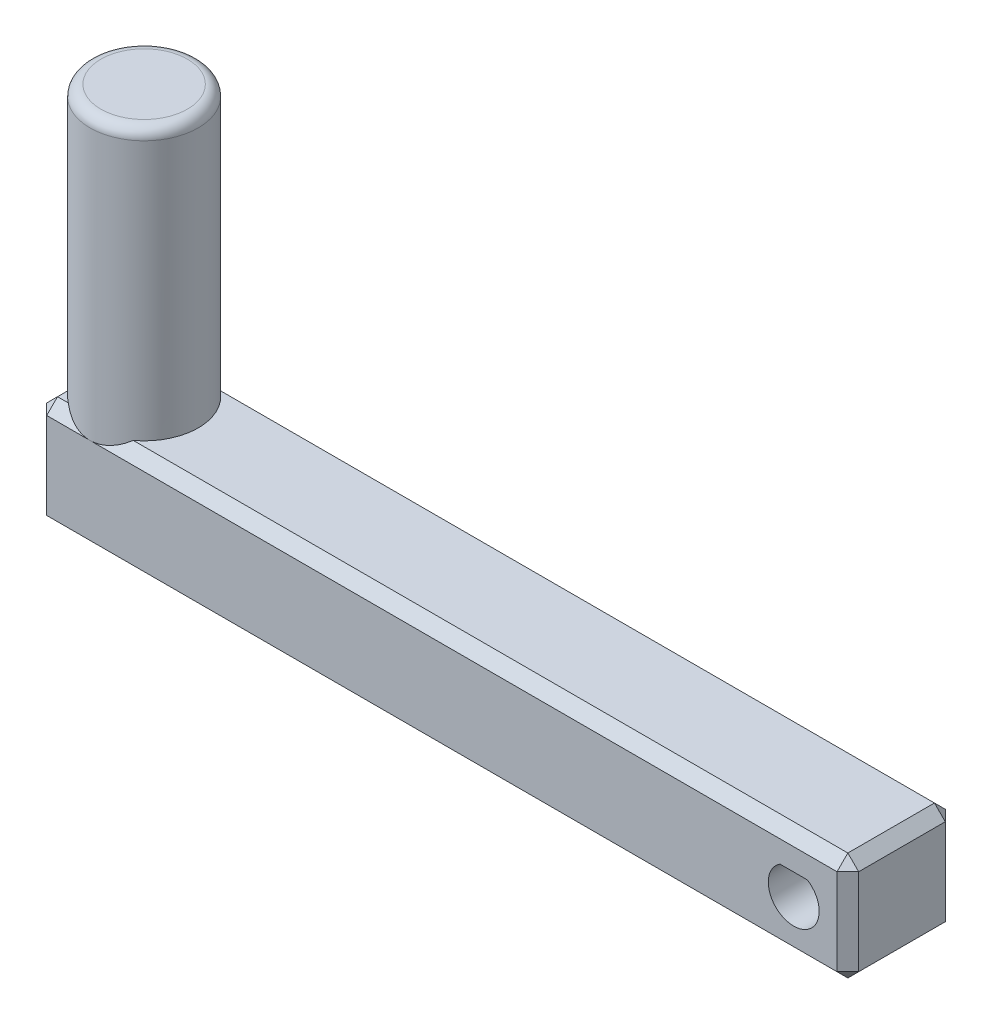
ISO-10303-21;
HEADER;
FILE_DESCRIPTION(('STEP AP214'),'2;1');
FILE_NAME('part.step','',(''),(''),'','','');
FILE_SCHEMA(('AUTOMOTIVE_DESIGN { 1 0 10303 214 1 1 1 1 }'));
ENDSEC;
DATA;
#1=APPLICATION_CONTEXT('core data for automotive mechanical design processes');
#2=APPLICATION_PROTOCOL_DEFINITION('international standard','automotive_design',2000,#1);
#3=PRODUCT_CONTEXT('',#1,'mechanical');
#4=PRODUCT('Part','Part','',(#3));
#5=PRODUCT_RELATED_PRODUCT_CATEGORY('part','',(#4));
#6=PRODUCT_DEFINITION_FORMATION('','',#4);
#7=PRODUCT_DEFINITION_CONTEXT('part definition',#1,'design');
#8=PRODUCT_DEFINITION('design','',#6,#7);
#9=PRODUCT_DEFINITION_SHAPE('','',#8);
#10=(LENGTH_UNIT() NAMED_UNIT(*) SI_UNIT(.MILLI.,.METRE.));
#11=(NAMED_UNIT(*) PLANE_ANGLE_UNIT() SI_UNIT($,.RADIAN.));
#12=(NAMED_UNIT(*) SI_UNIT($,.STERADIAN.) SOLID_ANGLE_UNIT());
#13=UNCERTAINTY_MEASURE_WITH_UNIT(LENGTH_MEASURE(1.E-05),#10,'distance_accuracy_value','');
#14=(GEOMETRIC_REPRESENTATION_CONTEXT(3) GLOBAL_UNCERTAINTY_ASSIGNED_CONTEXT((#13)) GLOBAL_UNIT_ASSIGNED_CONTEXT((#10,
#11,#12)) REPRESENTATION_CONTEXT('',''));
#15=CARTESIAN_POINT('',(0.,0.,0.));
#16=DIRECTION('',(0.,0.,1.));
#17=DIRECTION('',(1.,0.,0.));
#18=AXIS2_PLACEMENT_3D('',#15,#16,#17);
#19=CARTESIAN_POINT('',(0.,10.,0.));
#20=DIRECTION('',(0.,0.,1.));
#21=DIRECTION('',(1.,0.,0.));
#22=AXIS2_PLACEMENT_3D('',#19,#20,#21);
#23=PLANE('',#22);
#24=DIRECTION('',(0.,1.,0.));
#25=VECTOR('',#24,1.);
#26=CARTESIAN_POINT('',(-74.,10.,0.));
#27=LINE('',#26,#25);
#28=CARTESIAN_POINT('',(-74.,1.00000000000001,0.));
#29=VERTEX_POINT('',#28);
#30=CARTESIAN_POINT('',(-74.,8.99999999999998,0.));
#31=VERTEX_POINT('',#30);
#32=EDGE_CURVE('E212',#29,#31,#27,.T.);
#33=ORIENTED_EDGE('',*,*,#32,.T.);
#34=DIRECTION('',(1.,0.,0.));
#35=VECTOR('',#34,1.);
#36=CARTESIAN_POINT('',(0.,8.99999999999998,0.));
#37=LINE('',#36,#35);
#38=CARTESIAN_POINT('',(-70.,8.99999999999998,0.));
#39=VERTEX_POINT('',#38);
#40=EDGE_CURVE('E220',#31,#39,#37,.T.);
#41=ORIENTED_EDGE('',*,*,#40,.T.);
#42=DIRECTION('',(1.,0.,0.));
#43=VECTOR('',#42,1.);
#44=CARTESIAN_POINT('',(0.,8.99999999999998,0.));
#45=LINE('',#44,#43);
#46=CARTESIAN_POINT('',(-1.00000000000001,8.99999999999998,0.));
#47=VERTEX_POINT('',#46);
#48=EDGE_CURVE('E218',#39,#47,#45,.T.);
#49=ORIENTED_EDGE('',*,*,#48,.T.);
#50=DIRECTION('',(0.,-1.,0.));
#51=VECTOR('',#50,1.);
#52=CARTESIAN_POINT('',(-1.00000000000001,10.,0.));
#53=LINE('',#52,#51);
#54=CARTESIAN_POINT('',(-1.00000000000001,1.00000000000001,0.));
#55=VERTEX_POINT('',#54);
#56=EDGE_CURVE('E216',#47,#55,#53,.T.);
#57=ORIENTED_EDGE('',*,*,#56,.T.);
#58=DIRECTION('',(-1.,0.,0.));
#59=VECTOR('',#58,1.);
#60=CARTESIAN_POINT('',(-75.,1.00000000000001,0.));
#61=LINE('',#60,#59);
#62=EDGE_CURVE('E214',#55,#29,#61,.T.);
#63=ORIENTED_EDGE('',*,*,#62,.T.);
#64=EDGE_LOOP('',(#33,#41,#49,#57,#63));
#65=FACE_BOUND('',#64,.T.);
#66=DIRECTION('',(1.,0.,0.));
#67=VECTOR('',#66,1.);
#68=CARTESIAN_POINT('',(0.,6.97727084639409,0.));
#69=LINE('',#68,#67);
#70=CARTESIAN_POINT('',(-6.27,6.97727084639409,0.));
#71=VERTEX_POINT('',#70);
#72=CARTESIAN_POINT('',(-3.73,6.97727084639409,0.));
#73=VERTEX_POINT('',#72);
#74=EDGE_CURVE('E167',#71,#73,#69,.T.);
#75=ORIENTED_EDGE('',*,*,#74,.F.);
#76=CARTESIAN_POINT('',(-5.,5.,0.));
#77=DIRECTION('',(0.,0.,1.));
#78=DIRECTION('',(1.,0.,0.));
#79=AXIS2_PLACEMENT_3D('',#76,#77,#78);
#80=CIRCLE('',#79,2.35);
#81=EDGE_CURVE('E175',#71,#73,#80,.T.);
#82=ORIENTED_EDGE('',*,*,#81,.T.);
#83=EDGE_LOOP('',(#75,#82));
#84=FACE_BOUND('',#83,.T.);
#85=ADVANCED_FACE('F35',(#65,#84),#23,.F.);
#86=CARTESIAN_POINT('',(0.,10.,10.));
#87=DIRECTION('',(0.,0.,-1.));
#88=DIRECTION('',(-1.,0.,0.));
#89=AXIS2_PLACEMENT_3D('',#86,#87,#88);
#90=PLANE('',#89);
#91=DIRECTION('',(0.,1.,0.));
#92=VECTOR('',#91,1.);
#93=CARTESIAN_POINT('',(-1.00000000000001,10.,10.));
#94=LINE('',#93,#92);
#95=CARTESIAN_POINT('',(-1.00000000000001,1.00000000000001,10.));
#96=VERTEX_POINT('',#95);
#97=CARTESIAN_POINT('',(-1.00000000000001,8.99999999999999,10.));
#98=VERTEX_POINT('',#97);
#99=EDGE_CURVE('E201',#96,#98,#94,.T.);
#100=ORIENTED_EDGE('',*,*,#99,.T.);
#101=DIRECTION('',(-1.,0.,0.));
#102=VECTOR('',#101,1.);
#103=CARTESIAN_POINT('',(0.,8.99999999999999,10.));
#104=LINE('',#103,#102);
#105=CARTESIAN_POINT('',(-70.,8.99999999999999,10.));
#106=VERTEX_POINT('',#105);
#107=EDGE_CURVE('E206',#98,#106,#104,.T.);
#108=ORIENTED_EDGE('',*,*,#107,.T.);
#109=DIRECTION('',(-1.,0.,0.));
#110=VECTOR('',#109,1.);
#111=CARTESIAN_POINT('',(0.,8.99999999999999,10.));
#112=LINE('',#111,#110);
#113=CARTESIAN_POINT('',(-74.,8.99999999999999,10.));
#114=VERTEX_POINT('',#113);
#115=EDGE_CURVE('E203',#106,#114,#112,.T.);
#116=ORIENTED_EDGE('',*,*,#115,.T.);
#117=DIRECTION('',(0.,-1.,0.));
#118=VECTOR('',#117,1.);
#119=CARTESIAN_POINT('',(-74.,10.,10.));
#120=LINE('',#119,#118);
#121=CARTESIAN_POINT('',(-74.,1.00000000000001,10.));
#122=VERTEX_POINT('',#121);
#123=EDGE_CURVE('E199',#114,#122,#120,.T.);
#124=ORIENTED_EDGE('',*,*,#123,.T.);
#125=DIRECTION('',(1.,0.,0.));
#126=VECTOR('',#125,1.);
#127=CARTESIAN_POINT('',(0.,1.00000000000001,10.));
#128=LINE('',#127,#126);
#129=EDGE_CURVE('E197',#122,#96,#128,.T.);
#130=ORIENTED_EDGE('',*,*,#129,.T.);
#131=EDGE_LOOP('',(#100,#108,#116,#124,#130));
#132=FACE_BOUND('',#131,.T.);
#133=DIRECTION('',(1.,0.,0.));
#134=VECTOR('',#133,1.);
#135=CARTESIAN_POINT('',(0.,6.97727084639409,10.));
#136=LINE('',#135,#134);
#137=CARTESIAN_POINT('',(-6.27,6.97727084639409,10.));
#138=VERTEX_POINT('',#137);
#139=CARTESIAN_POINT('',(-3.73,6.97727084639409,10.));
#140=VERTEX_POINT('',#139);
#141=EDGE_CURVE('E170',#138,#140,#136,.T.);
#142=ORIENTED_EDGE('',*,*,#141,.T.);
#143=CARTESIAN_POINT('',(-5.,5.,10.));
#144=DIRECTION('',(0.,0.,1.));
#145=DIRECTION('',(1.,0.,0.));
#146=AXIS2_PLACEMENT_3D('',#143,#144,#145);
#147=CIRCLE('',#146,2.35);
#148=EDGE_CURVE('E180',#138,#140,#147,.T.);
#149=ORIENTED_EDGE('',*,*,#148,.F.);
#150=EDGE_LOOP('',(#142,#149));
#151=FACE_BOUND('',#150,.T.);
#152=ADVANCED_FACE('F353',(#132,#151),#90,.F.);
#153=CARTESIAN_POINT('',(0.,10.,0.));
#154=DIRECTION('',(0.,-1.,0.));
#155=DIRECTION('',(0.,0.,-1.));
#156=AXIS2_PLACEMENT_3D('',#153,#154,#155);
#157=PLANE('',#156);
#158=CARTESIAN_POINT('',(-70.,10.,5.));
#159=DIRECTION('',(0.,1.,0.));
#160=DIRECTION('',(0.,0.,1.));
#161=AXIS2_PLACEMENT_3D('',#158,#159,#160);
#162=CIRCLE('',#161,5.);
#163=CARTESIAN_POINT('',(-66.9999999999999,10.,8.99999999999998));
#164=VERTEX_POINT('',#163);
#165=CARTESIAN_POINT('',(-66.9999999999999,10.,1.00000000000002));
#166=VERTEX_POINT('',#165);
#167=EDGE_CURVE('E186',#164,#166,#162,.T.);
#168=ORIENTED_EDGE('',*,*,#167,.F.);
#169=DIRECTION('',(1.,0.,0.));
#170=VECTOR('',#169,1.);
#171=CARTESIAN_POINT('',(0.,10.,8.99999999999998));
#172=LINE('',#171,#170);
#173=CARTESIAN_POINT('',(-1.00000000000001,10.,8.99999999999998));
#174=VERTEX_POINT('',#173);
#175=EDGE_CURVE('E247',#164,#174,#172,.T.);
#176=ORIENTED_EDGE('',*,*,#175,.T.);
#177=DIRECTION('',(0.,0.,-1.));
#178=VECTOR('',#177,1.);
#179=CARTESIAN_POINT('',(-1.00000000000001,10.,0.));
#180=LINE('',#179,#178);
#181=CARTESIAN_POINT('',(-1.00000000000001,10.,1.00000000000001));
#182=VERTEX_POINT('',#181);
#183=EDGE_CURVE('E245',#174,#182,#180,.T.);
#184=ORIENTED_EDGE('',*,*,#183,.T.);
#185=DIRECTION('',(-1.,0.,0.));
#186=VECTOR('',#185,1.);
#187=CARTESIAN_POINT('',(0.,10.,1.00000000000001));
#188=LINE('',#187,#186);
#189=EDGE_CURVE('E243',#182,#166,#188,.T.);
#190=ORIENTED_EDGE('',*,*,#189,.T.);
#191=EDGE_LOOP('',(#168,#176,#184,#190));
#192=FACE_BOUND('',#191,.T.);
#193=ADVANCED_FACE('F359',(#192),#157,.F.);
#194=CARTESIAN_POINT('',(-73.,10.,1.00000000000002));
#195=VERTEX_POINT('',#194);
#196=CARTESIAN_POINT('',(-74.,10.,2.));
#197=VERTEX_POINT('',#196);
#198=EDGE_CURVE('E191',#195,#197,#162,.T.);
#199=ORIENTED_EDGE('',*,*,#198,.F.);
#200=DIRECTION('',(-1.,0.,0.));
#201=VECTOR('',#200,1.);
#202=CARTESIAN_POINT('',(0.,10.,1.00000000000001));
#203=LINE('',#202,#201);
#204=CARTESIAN_POINT('',(-74.,10.,1.00000000000002));
#205=VERTEX_POINT('',#204);
#206=EDGE_CURVE('E210',#195,#205,#203,.T.);
#207=ORIENTED_EDGE('',*,*,#206,.T.);
#208=DIRECTION('',(0.,0.,1.));
#209=VECTOR('',#208,1.);
#210=CARTESIAN_POINT('',(-74.,10.,0.));
#211=LINE('',#210,#209);
#212=EDGE_CURVE('E208',#205,#197,#211,.T.);
#213=ORIENTED_EDGE('',*,*,#212,.T.);
#214=EDGE_LOOP('',(#199,#207,#213));
#215=FACE_BOUND('',#214,.T.);
#216=ADVANCED_FACE('F528',(#215),#157,.F.);
#217=DIRECTION('',(0.,0.,1.));
#218=VECTOR('',#217,1.);
#219=CARTESIAN_POINT('',(-74.,10.,0.));
#220=LINE('',#219,#218);
#221=CARTESIAN_POINT('',(-74.,10.,8.));
#222=VERTEX_POINT('',#221);
#223=CARTESIAN_POINT('',(-74.,10.,8.99999999999999));
#224=VERTEX_POINT('',#223);
#225=EDGE_CURVE('E192',#222,#224,#220,.T.);
#226=ORIENTED_EDGE('',*,*,#225,.T.);
#227=DIRECTION('',(1.,0.,0.));
#228=VECTOR('',#227,1.);
#229=CARTESIAN_POINT('',(0.,10.,8.99999999999998));
#230=LINE('',#229,#228);
#231=CARTESIAN_POINT('',(-73.,10.,8.99999999999998));
#232=VERTEX_POINT('',#231);
#233=EDGE_CURVE('E194',#224,#232,#230,.T.);
#234=ORIENTED_EDGE('',*,*,#233,.T.);
#235=EDGE_CURVE('E190',#222,#232,#162,.T.);
#236=ORIENTED_EDGE('',*,*,#235,.F.);
#237=EDGE_LOOP('',(#226,#234,#236));
#238=FACE_BOUND('',#237,.T.);
#239=ADVANCED_FACE('F367',(#238),#157,.F.);
#240=CARTESIAN_POINT('',(0.,10.,0.));
#241=DIRECTION('',(-1.,0.,0.));
#242=DIRECTION('',(0.,0.,1.));
#243=AXIS2_PLACEMENT_3D('',#240,#241,#242);
#244=PLANE('',#243);
#245=DIRECTION('',(0.,0.,1.));
#246=VECTOR('',#245,1.);
#247=CARTESIAN_POINT('',(0.,8.99999999999998,0.));
#248=LINE('',#247,#246);
#249=CARTESIAN_POINT('',(0.,8.99999999999998,1.00000000000002));
#250=VERTEX_POINT('',#249);
#251=CARTESIAN_POINT('',(0.,8.99999999999998,8.99999999999998));
#252=VERTEX_POINT('',#251);
#253=EDGE_CURVE('E238',#250,#252,#248,.T.);
#254=ORIENTED_EDGE('',*,*,#253,.T.);
#255=DIRECTION('',(0.,-1.,0.));
#256=VECTOR('',#255,1.);
#257=CARTESIAN_POINT('',(0.,10.,8.99999999999998));
#258=LINE('',#257,#256);
#259=CARTESIAN_POINT('',(0.,1.00000000000001,8.99999999999998));
#260=VERTEX_POINT('',#259);
#261=EDGE_CURVE('E240',#252,#260,#258,.T.);
#262=ORIENTED_EDGE('',*,*,#261,.T.);
#263=DIRECTION('',(0.,0.,-1.));
#264=VECTOR('',#263,1.);
#265=CARTESIAN_POINT('',(0.,1.00000000000001,0.));
#266=LINE('',#265,#264);
#267=CARTESIAN_POINT('',(0.,1.00000000000001,1.00000000000002));
#268=VERTEX_POINT('',#267);
#269=EDGE_CURVE('E234',#260,#268,#266,.T.);
#270=ORIENTED_EDGE('',*,*,#269,.T.);
#271=DIRECTION('',(0.,1.,0.));
#272=VECTOR('',#271,1.);
#273=CARTESIAN_POINT('',(0.,10.,1.00000000000002));
#274=LINE('',#273,#272);
#275=EDGE_CURVE('E236',#268,#250,#274,.T.);
#276=ORIENTED_EDGE('',*,*,#275,.T.);
#277=EDGE_LOOP('',(#254,#262,#270,#276));
#278=FACE_BOUND('',#277,.T.);
#279=ADVANCED_FACE('F365',(#278),#244,.F.);
#280=CARTESIAN_POINT('',(-75.,10.,0.));
#281=DIRECTION('',(1.,0.,0.));
#282=DIRECTION('',(0.,0.,-1.));
#283=AXIS2_PLACEMENT_3D('',#280,#281,#282);
#284=PLANE('',#283);
#285=DIRECTION('',(0.,0.,-1.));
#286=VECTOR('',#285,1.);
#287=CARTESIAN_POINT('',(-75.,8.99999999999998,0.));
#288=LINE('',#287,#286);
#289=CARTESIAN_POINT('',(-75.,8.99999999999998,8.99999999999999));
#290=VERTEX_POINT('',#289);
#291=CARTESIAN_POINT('',(-75.,8.99999999999998,5.));
#292=VERTEX_POINT('',#291);
#293=EDGE_CURVE('E225',#290,#292,#288,.T.);
#294=ORIENTED_EDGE('',*,*,#293,.T.);
#295=DIRECTION('',(0.,0.,-1.));
#296=VECTOR('',#295,1.);
#297=CARTESIAN_POINT('',(-75.,8.99999999999998,0.));
#298=LINE('',#297,#296);
#299=CARTESIAN_POINT('',(-75.,8.99999999999998,1.00000000000002));
#300=VERTEX_POINT('',#299);
#301=EDGE_CURVE('E231',#292,#300,#298,.T.);
#302=ORIENTED_EDGE('',*,*,#301,.T.);
#303=DIRECTION('',(0.,-1.,0.));
#304=VECTOR('',#303,1.);
#305=CARTESIAN_POINT('',(-75.,10.,1.00000000000002));
#306=LINE('',#305,#304);
#307=CARTESIAN_POINT('',(-75.,1.00000000000001,1.00000000000002));
#308=VERTEX_POINT('',#307);
#309=EDGE_CURVE('E229',#300,#308,#306,.T.);
#310=ORIENTED_EDGE('',*,*,#309,.T.);
#311=DIRECTION('',(0.,0.,1.));
#312=VECTOR('',#311,1.);
#313=CARTESIAN_POINT('',(-75.,1.00000000000001,10.));
#314=LINE('',#313,#312);
#315=CARTESIAN_POINT('',(-75.,1.00000000000001,8.99999999999999));
#316=VERTEX_POINT('',#315);
#317=EDGE_CURVE('E227',#308,#316,#314,.T.);
#318=ORIENTED_EDGE('',*,*,#317,.T.);
#319=DIRECTION('',(0.,1.,0.));
#320=VECTOR('',#319,1.);
#321=CARTESIAN_POINT('',(-75.,10.,8.99999999999999));
#322=LINE('',#321,#320);
#323=EDGE_CURVE('E223',#316,#290,#322,.T.);
#324=ORIENTED_EDGE('',*,*,#323,.T.);
#325=EDGE_LOOP('',(#294,#302,#310,#318,#324));
#326=FACE_BOUND('',#325,.T.);
#327=ADVANCED_FACE('F364',(#326),#284,.F.);
#328=CARTESIAN_POINT('',(0.,0.,0.));
#329=DIRECTION('',(0.,-1.,0.));
#330=DIRECTION('',(0.,0.,-1.));
#331=AXIS2_PLACEMENT_3D('',#328,#329,#330);
#332=PLANE('',#331);
#333=DIRECTION('',(1.,0.,0.));
#334=VECTOR('',#333,1.);
#335=CARTESIAN_POINT('',(0.,0.,1.00000000000002));
#336=LINE('',#335,#334);
#337=CARTESIAN_POINT('',(-74.,0.,1.00000000000003));
#338=VERTEX_POINT('',#337);
#339=CARTESIAN_POINT('',(-1.00000000000002,0.,1.00000000000002));
#340=VERTEX_POINT('',#339);
#341=EDGE_CURVE('E51',#338,#340,#336,.T.);
#342=ORIENTED_EDGE('',*,*,#341,.T.);
#343=DIRECTION('',(0.,0.,1.));
#344=VECTOR('',#343,1.);
#345=CARTESIAN_POINT('',(-1.00000000000002,0.,10.));
#346=LINE('',#345,#344);
#347=CARTESIAN_POINT('',(-1.00000000000002,0.,8.99999999999998));
#348=VERTEX_POINT('',#347);
#349=EDGE_CURVE('E253',#340,#348,#346,.T.);
#350=ORIENTED_EDGE('',*,*,#349,.T.);
#351=DIRECTION('',(-1.,0.,0.));
#352=VECTOR('',#351,1.);
#353=CARTESIAN_POINT('',(-75.,0.,8.99999999999999));
#354=LINE('',#353,#352);
#355=CARTESIAN_POINT('',(-74.,0.,8.99999999999999));
#356=VERTEX_POINT('',#355);
#357=EDGE_CURVE('E249',#348,#356,#354,.T.);
#358=ORIENTED_EDGE('',*,*,#357,.T.);
#359=DIRECTION('',(0.,0.,-1.));
#360=VECTOR('',#359,1.);
#361=CARTESIAN_POINT('',(-74.,0.,0.));
#362=LINE('',#361,#360);
#363=EDGE_CURVE('E56',#356,#338,#362,.T.);
#364=ORIENTED_EDGE('',*,*,#363,.T.);
#365=EDGE_LOOP('',(#342,#350,#358,#364));
#366=FACE_BOUND('',#365,.T.);
#367=ADVANCED_FACE('F468',(#366),#332,.T.);
#368=CARTESIAN_POINT('',(-70.,35.,5.));
#369=DIRECTION('',(0.,-1.,0.));
#370=DIRECTION('',(0.,0.,-1.));
#371=AXIS2_PLACEMENT_3D('',#368,#369,#370);
#372=CYLINDRICAL_SURFACE('',#371,5.);
#373=CARTESIAN_POINT('',(-70.,34.,5.));
#374=DIRECTION('',(0.,1.,0.));
#375=DIRECTION('',(0.,0.,1.));
#376=AXIS2_PLACEMENT_3D('',#373,#374,#375);
#377=CIRCLE('',#376,5.);
#378=CARTESIAN_POINT('',(-70.,34.,10.));
#379=VERTEX_POINT('',#378);
#380=EDGE_CURVE('E11',#379,#379,#377,.F.);
#381=ORIENTED_EDGE('',*,*,#380,.T.);
#382=EDGE_LOOP('',(#381));
#383=FACE_BOUND('',#382,.T.);
#384=CARTESIAN_POINT('',(-70.,14.,5.));
#385=DIRECTION('',(0.,-0.70710678118655,-0.707106781186545));
#386=DIRECTION('',(0.,-0.707106781186545,0.70710678118655));
#387=AXIS2_PLACEMENT_3D('',#384,#385,#386);
#388=ELLIPSE('',#387,7.07106781186546,5.);
#389=EDGE_CURVE('E255',#232,#106,#388,.F.);
#390=ORIENTED_EDGE('',*,*,#389,.T.);
#391=CARTESIAN_POINT('',(-70.,14.,5.));
#392=DIRECTION('',(0.,-0.707106781186551,-0.707106781186544));
#393=DIRECTION('',(0.,-0.707106781186544,0.707106781186551));
#394=AXIS2_PLACEMENT_3D('',#391,#392,#393);
#395=ELLIPSE('',#394,7.07106781186545,5.);
#396=EDGE_CURVE('E263',#106,#164,#395,.F.);
#397=ORIENTED_EDGE('',*,*,#396,.T.);
#398=ORIENTED_EDGE('',*,*,#167,.T.);
#399=CARTESIAN_POINT('',(-70.,14.,5.));
#400=DIRECTION('',(0.,-0.707106781186545,0.70710678118655));
#401=DIRECTION('',(0.,-0.70710678118655,-0.707106781186545));
#402=AXIS2_PLACEMENT_3D('',#399,#400,#401);
#403=ELLIPSE('',#402,7.07106781186551,5.);
#404=EDGE_CURVE('E265',#166,#39,#403,.F.);
#405=ORIENTED_EDGE('',*,*,#404,.T.);
#406=CARTESIAN_POINT('',(-70.,14.,5.));
#407=DIRECTION('',(0.,-0.707106781186545,0.70710678118655));
#408=DIRECTION('',(0.,-0.70710678118655,-0.707106781186545));
#409=AXIS2_PLACEMENT_3D('',#406,#407,#408);
#410=ELLIPSE('',#409,7.07106781186551,5.);
#411=EDGE_CURVE('E258',#39,#195,#410,.F.);
#412=ORIENTED_EDGE('',*,*,#411,.T.);
#413=ORIENTED_EDGE('',*,*,#198,.T.);
#414=CARTESIAN_POINT('',(-70.,14.,5.));
#415=DIRECTION('',(0.70710678118655,-0.707106781186545,0.));
#416=DIRECTION('',(-0.707106781186545,-0.70710678118655,0.));
#417=AXIS2_PLACEMENT_3D('',#414,#415,#416);
#418=ELLIPSE('',#417,7.07106781186551,5.);
#419=EDGE_CURVE('E260',#197,#292,#418,.F.);
#420=ORIENTED_EDGE('',*,*,#419,.T.);
#421=CARTESIAN_POINT('',(-70.,14.,5.));
#422=DIRECTION('',(0.70710678118655,-0.707106781186545,0.));
#423=DIRECTION('',(-0.707106781186545,-0.70710678118655,0.));
#424=AXIS2_PLACEMENT_3D('',#421,#422,#423);
#425=ELLIPSE('',#424,7.07106781186551,5.);
#426=EDGE_CURVE('E268',#292,#222,#425,.F.);
#427=ORIENTED_EDGE('',*,*,#426,.T.);
#428=ORIENTED_EDGE('',*,*,#235,.T.);
#429=EDGE_LOOP('',(#390,#397,#398,#405,#412,#413,#420,#427,#428));
#430=FACE_BOUND('',#429,.T.);
#431=ADVANCED_FACE('F488',(#383,#430),#372,.T.);
#432=CARTESIAN_POINT('',(-70.,35.,5.));
#433=DIRECTION('',(0.,1.,0.));
#434=DIRECTION('',(0.,0.,1.));
#435=AXIS2_PLACEMENT_3D('',#432,#433,#434);
#436=PLANE('',#435);
#437=CARTESIAN_POINT('',(-70.,35.,5.));
#438=DIRECTION('',(0.,1.,0.));
#439=DIRECTION('',(0.,0.,1.));
#440=AXIS2_PLACEMENT_3D('',#437,#438,#439);
#441=CIRCLE('',#440,4.);
#442=CARTESIAN_POINT('',(-70.,35.,9.00000000000001));
#443=VERTEX_POINT('',#442);
#444=EDGE_CURVE('E44',#443,#443,#441,.T.);
#445=ORIENTED_EDGE('',*,*,#444,.T.);
#446=EDGE_LOOP('',(#445));
#447=FACE_BOUND('',#446,.T.);
#448=ADVANCED_FACE('F340',(#447),#436,.T.);
#449=CARTESIAN_POINT('',(0.,6.97727084639409,0.));
#450=DIRECTION('',(0.,-1.,0.));
#451=DIRECTION('',(0.,0.,-1.));
#452=AXIS2_PLACEMENT_3D('',#449,#450,#451);
#453=PLANE('',#452);
#454=ORIENTED_EDGE('',*,*,#141,.F.);
#455=DIRECTION('',(0.,0.,1.));
#456=VECTOR('',#455,1.);
#457=CARTESIAN_POINT('',(-6.27,6.97727084639409,0.));
#458=LINE('',#457,#456);
#459=EDGE_CURVE('E163',#71,#138,#458,.T.);
#460=ORIENTED_EDGE('',*,*,#459,.F.);
#461=ORIENTED_EDGE('',*,*,#74,.T.);
#462=DIRECTION('',(0.,0.,1.));
#463=VECTOR('',#462,1.);
#464=CARTESIAN_POINT('',(-3.73,6.97727084639409,0.));
#465=LINE('',#464,#463);
#466=EDGE_CURVE('E174',#73,#140,#465,.T.);
#467=ORIENTED_EDGE('',*,*,#466,.T.);
#468=EDGE_LOOP('',(#454,#460,#461,#467));
#469=FACE_BOUND('',#468,.T.);
#470=ADVANCED_FACE('F165',(#469),#453,.T.);
#471=CARTESIAN_POINT('',(-5.,5.,0.));
#472=DIRECTION('',(0.,0.,1.));
#473=DIRECTION('',(1.,0.,0.));
#474=AXIS2_PLACEMENT_3D('',#471,#472,#473);
#475=CYLINDRICAL_SURFACE('',#474,2.35);
#476=ORIENTED_EDGE('',*,*,#148,.T.);
#477=ORIENTED_EDGE('',*,*,#466,.F.);
#478=ORIENTED_EDGE('',*,*,#81,.F.);
#479=ORIENTED_EDGE('',*,*,#459,.T.);
#480=EDGE_LOOP('',(#476,#477,#478,#479));
#481=FACE_BOUND('',#480,.T.);
#482=ADVANCED_FACE('F177',(#481),#475,.F.);
#483=CARTESIAN_POINT('',(0.,1.00000000000001,0.));
#484=DIRECTION('',(0.,-0.70710678118655,-0.707106781186545));
#485=DIRECTION('',(1.,0.,0.));
#486=AXIS2_PLACEMENT_3D('',#483,#484,#485);
#487=PLANE('',#486);
#488=DIRECTION('',(0.,0.707106781186545,-0.70710678118655));
#489=VECTOR('',#488,1.);
#490=CARTESIAN_POINT('',(-1.00000000000001,1.00000000000001,0.));
#491=LINE('',#490,#489);
#492=EDGE_CURVE('E184',#340,#55,#491,.T.);
#493=ORIENTED_EDGE('',*,*,#492,.F.);
#494=ORIENTED_EDGE('',*,*,#341,.F.);
#495=DIRECTION('',(0.,-0.707106781186545,0.70710678118655));
#496=VECTOR('',#495,1.);
#497=CARTESIAN_POINT('',(-74.,1.00000000000001,0.));
#498=LINE('',#497,#496);
#499=EDGE_CURVE('E332',#29,#338,#498,.T.);
#500=ORIENTED_EDGE('',*,*,#499,.F.);
#501=ORIENTED_EDGE('',*,*,#62,.F.);
#502=EDGE_LOOP('',(#493,#494,#500,#501));
#503=FACE_BOUND('',#502,.T.);
#504=ADVANCED_FACE('F451',(#503),#487,.T.);
#505=CARTESIAN_POINT('',(-1.00000000000001,1.00000000000001,0.));
#506=DIRECTION('',(0.577350269189626,-0.57735026918963,-0.577350269189622));
#507=DIRECTION('',(0.70710678118655,0.707106781186545,0.));
#508=AXIS2_PLACEMENT_3D('',#505,#506,#507);
#509=PLANE('',#508);
#510=DIRECTION('',(-0.70710678118655,-0.707106781186545,0.));
#511=VECTOR('',#510,1.);
#512=CARTESIAN_POINT('',(-0.500000000000011,0.500000000000007,1.00000000000002));
#513=LINE('',#512,#511);
#514=EDGE_CURVE('E323',#340,#268,#513,.F.);
#515=ORIENTED_EDGE('',*,*,#514,.F.);
#516=ORIENTED_EDGE('',*,*,#492,.T.);
#517=DIRECTION('',(-0.707106781186545,0.,-0.70710678118655));
#518=VECTOR('',#517,1.);
#519=CARTESIAN_POINT('',(-1.00000000000001,1.00000000000001,0.));
#520=LINE('',#519,#518);
#521=EDGE_CURVE('E326',#268,#55,#520,.T.);
#522=ORIENTED_EDGE('',*,*,#521,.F.);
#523=EDGE_LOOP('',(#515,#516,#522));
#524=FACE_BOUND('',#523,.T.);
#525=ADVANCED_FACE('F448',(#524),#509,.T.);
#526=CARTESIAN_POINT('',(-74.,1.00000000000001,0.));
#527=DIRECTION('',(-0.577350269189625,-0.577350269189628,-0.577350269189625));
#528=DIRECTION('',(0.,0.707106781186545,-0.70710678118655));
#529=AXIS2_PLACEMENT_3D('',#526,#527,#528);
#530=PLANE('',#529);
#531=DIRECTION('',(-0.707106781186548,0.707106781186548,0.));
#532=VECTOR('',#531,1.);
#533=CARTESIAN_POINT('',(-74.5,0.500000000000011,1.00000000000003));
#534=LINE('',#533,#532);
#535=EDGE_CURVE('E320',#308,#338,#534,.F.);
#536=ORIENTED_EDGE('',*,*,#535,.F.);
#537=DIRECTION('',(-0.707106781186547,0.,0.707106781186547));
#538=VECTOR('',#537,1.);
#539=CARTESIAN_POINT('',(-74.,1.00000000000001,0.));
#540=LINE('',#539,#538);
#541=EDGE_CURVE('E329',#29,#308,#540,.T.);
#542=ORIENTED_EDGE('',*,*,#541,.F.);
#543=ORIENTED_EDGE('',*,*,#499,.T.);
#544=EDGE_LOOP('',(#536,#542,#543));
#545=FACE_BOUND('',#544,.T.);
#546=ADVANCED_FACE('F444',(#545),#530,.T.);
#547=CARTESIAN_POINT('',(-75.,10.,1.00000000000002));
#548=DIRECTION('',(0.707106781186547,0.,0.707106781186547));
#549=DIRECTION('',(0.,-1.,0.));
#550=AXIS2_PLACEMENT_3D('',#547,#548,#549);
#551=PLANE('',#550);
#552=ORIENTED_EDGE('',*,*,#541,.T.);
#553=ORIENTED_EDGE('',*,*,#309,.F.);
#554=DIRECTION('',(0.707106781186548,0.,-0.707106781186548));
#555=VECTOR('',#554,1.);
#556=CARTESIAN_POINT('',(-74.5,8.99999999999998,0.500000000000016));
#557=LINE('',#556,#555);
#558=EDGE_CURVE('E317',#31,#300,#557,.F.);
#559=ORIENTED_EDGE('',*,*,#558,.F.);
#560=ORIENTED_EDGE('',*,*,#32,.F.);
#561=EDGE_LOOP('',(#552,#553,#559,#560));
#562=FACE_BOUND('',#561,.T.);
#563=ADVANCED_FACE('F440',(#562),#551,.F.);
#564=CARTESIAN_POINT('',(0.,10.,1.00000000000001));
#565=DIRECTION('',(0.,-0.707106781186545,0.70710678118655));
#566=DIRECTION('',(-1.,0.,0.));
#567=AXIS2_PLACEMENT_3D('',#564,#565,#566);
#568=PLANE('',#567);
#569=ORIENTED_EDGE('',*,*,#206,.F.);
#570=ORIENTED_EDGE('',*,*,#411,.F.);
#571=ORIENTED_EDGE('',*,*,#40,.F.);
#572=DIRECTION('',(0.,0.70710678118655,0.707106781186545));
#573=VECTOR('',#572,1.);
#574=CARTESIAN_POINT('',(-74.,10.,1.00000000000002));
#575=LINE('',#574,#573);
#576=EDGE_CURVE('E314',#205,#31,#575,.F.);
#577=ORIENTED_EDGE('',*,*,#576,.F.);
#578=EDGE_LOOP('',(#569,#570,#571,#577));
#579=FACE_BOUND('',#578,.T.);
#580=ADVANCED_FACE('F436',(#579),#568,.F.);
#581=CARTESIAN_POINT('',(0.,10.,1.00000000000001));
#582=DIRECTION('',(0.,-0.707106781186545,0.70710678118655));
#583=DIRECTION('',(-1.,0.,0.));
#584=AXIS2_PLACEMENT_3D('',#581,#582,#583);
#585=PLANE('',#584);
#586=ORIENTED_EDGE('',*,*,#404,.F.);
#587=ORIENTED_EDGE('',*,*,#189,.F.);
#588=DIRECTION('',(0.,-0.70710678118655,-0.707106781186545));
#589=VECTOR('',#588,1.);
#590=CARTESIAN_POINT('',(-1.00000000000001,10.,1.00000000000001));
#591=LINE('',#590,#589);
#592=EDGE_CURVE('E311',#47,#182,#591,.F.);
#593=ORIENTED_EDGE('',*,*,#592,.F.);
#594=ORIENTED_EDGE('',*,*,#48,.F.);
#595=EDGE_LOOP('',(#586,#587,#593,#594));
#596=FACE_BOUND('',#595,.T.);
#597=ADVANCED_FACE('F432',(#596),#585,.F.);
#598=CARTESIAN_POINT('',(-1.00000000000001,10.,0.));
#599=DIRECTION('',(-0.70710678118655,0.,0.707106781186545));
#600=DIRECTION('',(0.,-1.,0.));
#601=AXIS2_PLACEMENT_3D('',#598,#599,#600);
#602=PLANE('',#601);
#603=ORIENTED_EDGE('',*,*,#521,.T.);
#604=ORIENTED_EDGE('',*,*,#56,.F.);
#605=DIRECTION('',(0.707106781186545,0.,0.70710678118655));
#606=VECTOR('',#605,1.);
#607=CARTESIAN_POINT('',(-0.500000000000007,8.99999999999998,0.500000000000011));
#608=LINE('',#607,#606);
#609=EDGE_CURVE('E308',#250,#47,#608,.F.);
#610=ORIENTED_EDGE('',*,*,#609,.F.);
#611=ORIENTED_EDGE('',*,*,#275,.F.);
#612=EDGE_LOOP('',(#603,#604,#610,#611));
#613=FACE_BOUND('',#612,.T.);
#614=ADVANCED_FACE('F428',(#613),#602,.F.);
#615=CARTESIAN_POINT('',(0.,1.00000000000001,0.));
#616=DIRECTION('',(0.707106781186545,-0.70710678118655,0.));
#617=DIRECTION('',(0.,0.,1.));
#618=AXIS2_PLACEMENT_3D('',#615,#616,#617);
#619=PLANE('',#618);
#620=ORIENTED_EDGE('',*,*,#514,.T.);
#621=ORIENTED_EDGE('',*,*,#269,.F.);
#622=DIRECTION('',(0.70710678118655,0.707106781186545,0.));
#623=VECTOR('',#622,1.);
#624=CARTESIAN_POINT('',(0.,1.00000000000001,8.99999999999998));
#625=LINE('',#624,#623);
#626=EDGE_CURVE('E305',#348,#260,#625,.T.);
#627=ORIENTED_EDGE('',*,*,#626,.F.);
#628=ORIENTED_EDGE('',*,*,#349,.F.);
#629=EDGE_LOOP('',(#620,#621,#627,#628));
#630=FACE_BOUND('',#629,.T.);
#631=ADVANCED_FACE('F424',(#630),#619,.T.);
#632=CARTESIAN_POINT('',(0.,1.00000000000001,10.));
#633=DIRECTION('',(0.,-0.707106781186549,0.707106781186546));
#634=DIRECTION('',(-1.,0.,0.));
#635=AXIS2_PLACEMENT_3D('',#632,#633,#634);
#636=PLANE('',#635);
#637=DIRECTION('',(0.,0.707106781186546,0.707106781186549));
#638=VECTOR('',#637,1.);
#639=CARTESIAN_POINT('',(-74.,0.500000000000004,9.49999999999999));
#640=LINE('',#639,#638);
#641=EDGE_CURVE('E300',#356,#122,#640,.T.);
#642=ORIENTED_EDGE('',*,*,#641,.F.);
#643=ORIENTED_EDGE('',*,*,#357,.F.);
#644=DIRECTION('',(0.,-0.707106781186546,-0.707106781186549));
#645=VECTOR('',#644,1.);
#646=CARTESIAN_POINT('',(-1.00000000000002,0.500000000000007,9.49999999999999));
#647=LINE('',#646,#645);
#648=EDGE_CURVE('E303',#96,#348,#647,.T.);
#649=ORIENTED_EDGE('',*,*,#648,.F.);
#650=ORIENTED_EDGE('',*,*,#129,.F.);
#651=EDGE_LOOP('',(#642,#643,#649,#650));
#652=FACE_BOUND('',#651,.T.);
#653=ADVANCED_FACE('F420',(#652),#636,.T.);
#654=CARTESIAN_POINT('',(-75.,1.00000000000001,0.));
#655=DIRECTION('',(-0.707106781186547,-0.707106781186547,0.));
#656=DIRECTION('',(0.,0.,-1.));
#657=AXIS2_PLACEMENT_3D('',#654,#655,#656);
#658=PLANE('',#657);
#659=ORIENTED_EDGE('',*,*,#535,.T.);
#660=ORIENTED_EDGE('',*,*,#363,.F.);
#661=DIRECTION('',(0.707106781186547,-0.707106781186547,0.));
#662=VECTOR('',#661,1.);
#663=CARTESIAN_POINT('',(-75.,1.00000000000001,8.99999999999999));
#664=LINE('',#663,#662);
#665=EDGE_CURVE('E297',#316,#356,#664,.T.);
#666=ORIENTED_EDGE('',*,*,#665,.F.);
#667=ORIENTED_EDGE('',*,*,#317,.F.);
#668=EDGE_LOOP('',(#659,#660,#666,#667));
#669=FACE_BOUND('',#668,.T.);
#670=ADVANCED_FACE('F416',(#669),#658,.T.);
#671=CARTESIAN_POINT('',(-74.,10.,1.00000000000002));
#672=DIRECTION('',(-0.577350269189627,0.577350269189623,-0.577350269189627));
#673=DIRECTION('',(-0.707106781186548,0.,0.707106781186548));
#674=AXIS2_PLACEMENT_3D('',#671,#672,#673);
#675=PLANE('',#674);
#676=ORIENTED_EDGE('',*,*,#576,.T.);
#677=ORIENTED_EDGE('',*,*,#558,.T.);
#678=DIRECTION('',(-0.707106781186545,-0.70710678118655,0.));
#679=VECTOR('',#678,1.);
#680=CARTESIAN_POINT('',(-74.,10.,1.00000000000002));
#681=LINE('',#680,#679);
#682=EDGE_CURVE('E295',#205,#300,#681,.T.);
#683=ORIENTED_EDGE('',*,*,#682,.F.);
#684=EDGE_LOOP('',(#676,#677,#683));
#685=FACE_BOUND('',#684,.T.);
#686=ADVANCED_FACE('F412',(#685),#675,.T.);
#687=CARTESIAN_POINT('',(-1.00000000000001,10.,1.00000000000001));
#688=DIRECTION('',(0.57735026918963,0.577350269189622,-0.577350269189626));
#689=DIRECTION('',(-0.707106781186545,0.,-0.70710678118655));
#690=AXIS2_PLACEMENT_3D('',#687,#688,#689);
#691=PLANE('',#690);
#692=ORIENTED_EDGE('',*,*,#609,.T.);
#693=ORIENTED_EDGE('',*,*,#592,.T.);
#694=DIRECTION('',(-0.707106781186545,0.70710678118655,0.));
#695=VECTOR('',#694,1.);
#696=CARTESIAN_POINT('',(-1.00000000000001,10.,1.00000000000001));
#697=LINE('',#696,#695);
#698=EDGE_CURVE('E292',#250,#182,#697,.T.);
#699=ORIENTED_EDGE('',*,*,#698,.F.);
#700=EDGE_LOOP('',(#692,#693,#699));
#701=FACE_BOUND('',#700,.T.);
#702=ADVANCED_FACE('F408',(#701),#691,.T.);
#703=CARTESIAN_POINT('',(0.,1.00000000000001,8.99999999999998));
#704=DIRECTION('',(0.577350269189626,-0.577350269189629,0.577350269189622));
#705=DIRECTION('',(0.707106781186549,0.707106781186546,0.));
#706=AXIS2_PLACEMENT_3D('',#703,#704,#705);
#707=PLANE('',#706);
#708=ORIENTED_EDGE('',*,*,#648,.T.);
#709=ORIENTED_EDGE('',*,*,#626,.T.);
#710=DIRECTION('',(0.707106781186545,0.,-0.70710678118655));
#711=VECTOR('',#710,1.);
#712=CARTESIAN_POINT('',(0.,1.00000000000001,8.99999999999998));
#713=LINE('',#712,#711);
#714=EDGE_CURVE('E290',#96,#260,#713,.T.);
#715=ORIENTED_EDGE('',*,*,#714,.F.);
#716=EDGE_LOOP('',(#708,#709,#715));
#717=FACE_BOUND('',#716,.T.);
#718=ADVANCED_FACE('F404',(#717),#707,.T.);
#719=CARTESIAN_POINT('',(-75.,1.00000000000001,8.99999999999999));
#720=DIRECTION('',(-0.577350269189627,-0.577350269189626,0.577350269189624));
#721=DIRECTION('',(0.707106781186547,-0.707106781186548,0.));
#722=AXIS2_PLACEMENT_3D('',#719,#720,#721);
#723=PLANE('',#722);
#724=ORIENTED_EDGE('',*,*,#665,.T.);
#725=ORIENTED_EDGE('',*,*,#641,.T.);
#726=DIRECTION('',(0.707106781186545,0.,0.70710678118655));
#727=VECTOR('',#726,1.);
#728=CARTESIAN_POINT('',(-75.,1.00000000000001,8.99999999999999));
#729=LINE('',#728,#727);
#730=EDGE_CURVE('E287',#316,#122,#729,.T.);
#731=ORIENTED_EDGE('',*,*,#730,.F.);
#732=EDGE_LOOP('',(#724,#725,#731));
#733=FACE_BOUND('',#732,.T.);
#734=ADVANCED_FACE('F400',(#733),#723,.T.);
#735=CARTESIAN_POINT('',(-74.,10.,0.));
#736=DIRECTION('',(0.70710678118655,-0.707106781186545,0.));
#737=DIRECTION('',(0.,0.,1.));
#738=AXIS2_PLACEMENT_3D('',#735,#736,#737);
#739=PLANE('',#738);
#740=ORIENTED_EDGE('',*,*,#682,.T.);
#741=ORIENTED_EDGE('',*,*,#301,.F.);
#742=ORIENTED_EDGE('',*,*,#419,.F.);
#743=ORIENTED_EDGE('',*,*,#212,.F.);
#744=EDGE_LOOP('',(#740,#741,#742,#743));
#745=FACE_BOUND('',#744,.T.);
#746=ADVANCED_FACE('F396',(#745),#739,.F.);
#747=CARTESIAN_POINT('',(-1.00000000000001,10.,0.));
#748=DIRECTION('',(-0.70710678118655,-0.707106781186545,0.));
#749=DIRECTION('',(0.,0.,-1.));
#750=AXIS2_PLACEMENT_3D('',#747,#748,#749);
#751=PLANE('',#750);
#752=ORIENTED_EDGE('',*,*,#698,.T.);
#753=ORIENTED_EDGE('',*,*,#183,.F.);
#754=DIRECTION('',(0.707106781186545,-0.70710678118655,0.));
#755=VECTOR('',#754,1.);
#756=CARTESIAN_POINT('',(-0.500000000000005,9.49999999999999,8.99999999999998));
#757=LINE('',#756,#755);
#758=EDGE_CURVE('E284',#252,#174,#757,.F.);
#759=ORIENTED_EDGE('',*,*,#758,.F.);
#760=ORIENTED_EDGE('',*,*,#253,.F.);
#761=EDGE_LOOP('',(#752,#753,#759,#760));
#762=FACE_BOUND('',#761,.T.);
#763=ADVANCED_FACE('F392',(#762),#751,.F.);
#764=CARTESIAN_POINT('',(0.,10.,8.99999999999998));
#765=DIRECTION('',(-0.70710678118655,0.,-0.707106781186545));
#766=DIRECTION('',(0.,-1.,0.));
#767=AXIS2_PLACEMENT_3D('',#764,#765,#766);
#768=PLANE('',#767);
#769=ORIENTED_EDGE('',*,*,#714,.T.);
#770=ORIENTED_EDGE('',*,*,#261,.F.);
#771=DIRECTION('',(-0.707106781186545,0.,0.70710678118655));
#772=VECTOR('',#771,1.);
#773=CARTESIAN_POINT('',(-1.00000000000001,8.99999999999999,10.));
#774=LINE('',#773,#772);
#775=EDGE_CURVE('E281',#98,#252,#774,.F.);
#776=ORIENTED_EDGE('',*,*,#775,.F.);
#777=ORIENTED_EDGE('',*,*,#99,.F.);
#778=EDGE_LOOP('',(#769,#770,#776,#777));
#779=FACE_BOUND('',#778,.T.);
#780=ADVANCED_FACE('F388',(#779),#768,.F.);
#781=CARTESIAN_POINT('',(-74.,10.,10.));
#782=DIRECTION('',(0.70710678118655,0.,-0.707106781186545));
#783=DIRECTION('',(0.,-1.,0.));
#784=AXIS2_PLACEMENT_3D('',#781,#782,#783);
#785=PLANE('',#784);
#786=ORIENTED_EDGE('',*,*,#730,.T.);
#787=ORIENTED_EDGE('',*,*,#123,.F.);
#788=DIRECTION('',(-0.707106781186545,0.,-0.70710678118655));
#789=VECTOR('',#788,1.);
#790=CARTESIAN_POINT('',(-74.,8.99999999999999,10.));
#791=LINE('',#790,#789);
#792=EDGE_CURVE('E278',#290,#114,#791,.F.);
#793=ORIENTED_EDGE('',*,*,#792,.F.);
#794=ORIENTED_EDGE('',*,*,#323,.F.);
#795=EDGE_LOOP('',(#786,#787,#793,#794));
#796=FACE_BOUND('',#795,.T.);
#797=ADVANCED_FACE('F384',(#796),#785,.F.);
#798=CARTESIAN_POINT('',(-74.,10.,0.));
#799=DIRECTION('',(0.70710678118655,-0.707106781186545,0.));
#800=DIRECTION('',(0.,0.,1.));
#801=AXIS2_PLACEMENT_3D('',#798,#799,#800);
#802=PLANE('',#801);
#803=ORIENTED_EDGE('',*,*,#426,.F.);
#804=ORIENTED_EDGE('',*,*,#293,.F.);
#805=DIRECTION('',(0.707106781186545,0.70710678118655,0.));
#806=VECTOR('',#805,1.);
#807=CARTESIAN_POINT('',(-74.5,9.49999999999999,8.99999999999999));
#808=LINE('',#807,#806);
#809=EDGE_CURVE('E275',#224,#290,#808,.F.);
#810=ORIENTED_EDGE('',*,*,#809,.F.);
#811=ORIENTED_EDGE('',*,*,#225,.F.);
#812=EDGE_LOOP('',(#803,#804,#810,#811));
#813=FACE_BOUND('',#812,.T.);
#814=ADVANCED_FACE('F380',(#813),#802,.F.);
#815=CARTESIAN_POINT('',(-1.00000000000001,8.99999999999999,10.));
#816=DIRECTION('',(0.577350269189629,0.577350269189627,0.577350269189621));
#817=DIRECTION('',(-0.707106781186546,0.707106781186549,0.));
#818=AXIS2_PLACEMENT_3D('',#815,#816,#817);
#819=PLANE('',#818);
#820=ORIENTED_EDGE('',*,*,#775,.T.);
#821=ORIENTED_EDGE('',*,*,#758,.T.);
#822=DIRECTION('',(0.,0.707106781186544,-0.707106781186551));
#823=VECTOR('',#822,1.);
#824=CARTESIAN_POINT('',(-1.00000000000001,8.99999999999999,10.));
#825=LINE('',#824,#823);
#826=EDGE_CURVE('E272',#98,#174,#825,.T.);
#827=ORIENTED_EDGE('',*,*,#826,.F.);
#828=EDGE_LOOP('',(#820,#821,#827));
#829=FACE_BOUND('',#828,.T.);
#830=ADVANCED_FACE('F376',(#829),#819,.T.);
#831=CARTESIAN_POINT('',(-74.,8.99999999999999,10.));
#832=DIRECTION('',(-0.57735026918963,0.577350269189626,0.577350269189622));
#833=DIRECTION('',(-0.707106781186545,-0.70710678118655,0.));
#834=AXIS2_PLACEMENT_3D('',#831,#832,#833);
#835=PLANE('',#834);
#836=ORIENTED_EDGE('',*,*,#809,.T.);
#837=ORIENTED_EDGE('',*,*,#792,.T.);
#838=DIRECTION('',(0.,-0.707106781186545,0.70710678118655));
#839=VECTOR('',#838,1.);
#840=CARTESIAN_POINT('',(-74.,8.99999999999999,10.));
#841=LINE('',#840,#839);
#842=EDGE_CURVE('E270',#224,#114,#841,.T.);
#843=ORIENTED_EDGE('',*,*,#842,.F.);
#844=EDGE_LOOP('',(#836,#837,#843));
#845=FACE_BOUND('',#844,.T.);
#846=ADVANCED_FACE('F372',(#845),#835,.T.);
#847=CARTESIAN_POINT('',(0.,10.,8.99999999999998));
#848=DIRECTION('',(0.,-0.707106781186551,-0.707106781186544));
#849=DIRECTION('',(1.,0.,0.));
#850=AXIS2_PLACEMENT_3D('',#847,#848,#849);
#851=PLANE('',#850);
#852=ORIENTED_EDGE('',*,*,#175,.F.);
#853=ORIENTED_EDGE('',*,*,#396,.F.);
#854=ORIENTED_EDGE('',*,*,#107,.F.);
#855=ORIENTED_EDGE('',*,*,#826,.T.);
#856=EDGE_LOOP('',(#852,#853,#854,#855));
#857=FACE_BOUND('',#856,.T.);
#858=ADVANCED_FACE('F348',(#857),#851,.F.);
#859=CARTESIAN_POINT('',(0.,10.,8.99999999999998));
#860=DIRECTION('',(0.,-0.70710678118655,-0.707106781186545));
#861=DIRECTION('',(1.,0.,0.));
#862=AXIS2_PLACEMENT_3D('',#859,#860,#861);
#863=PLANE('',#862);
#864=ORIENTED_EDGE('',*,*,#842,.T.);
#865=ORIENTED_EDGE('',*,*,#115,.F.);
#866=ORIENTED_EDGE('',*,*,#389,.F.);
#867=ORIENTED_EDGE('',*,*,#233,.F.);
#868=EDGE_LOOP('',(#864,#865,#866,#867));
#869=FACE_BOUND('',#868,.T.);
#870=ADVANCED_FACE('F343',(#869),#863,.F.);
#871=CARTESIAN_POINT('',(-70.,34.,5.));
#872=DIRECTION('',(0.,1.,0.));
#873=DIRECTION('',(0.,0.,1.));
#874=AXIS2_PLACEMENT_3D('',#871,#872,#873);
#875=TOROIDAL_SURFACE('',#874,4.,1.);
#876=ORIENTED_EDGE('',*,*,#380,.F.);
#877=EDGE_LOOP('',(#876));
#878=FACE_BOUND('',#877,.T.);
#879=ORIENTED_EDGE('',*,*,#444,.F.);
#880=EDGE_LOOP('',(#879));
#881=FACE_BOUND('',#880,.T.);
#882=ADVANCED_FACE('F37',(#878,#881),#875,.T.);
#883=CLOSED_SHELL('',(#85,#152,#193,#216,#239,#279,#327,#367,#431,#448,#470,#482,#504,#525,#546,
#563,#580,#597,#614,#631,#653,#670,#686,#702,#718,#734,#746,#763,#780,#797,#814,#830,#846,#858,
#870,#882));
#884=MANIFOLD_SOLID_BREP('B2',#883);
#885=ADVANCED_BREP_SHAPE_REPRESENTATION('',(#18,#884),#14);
#886=SHAPE_DEFINITION_REPRESENTATION(#9,#885);
ENDSEC;
END-ISO-10303-21;
